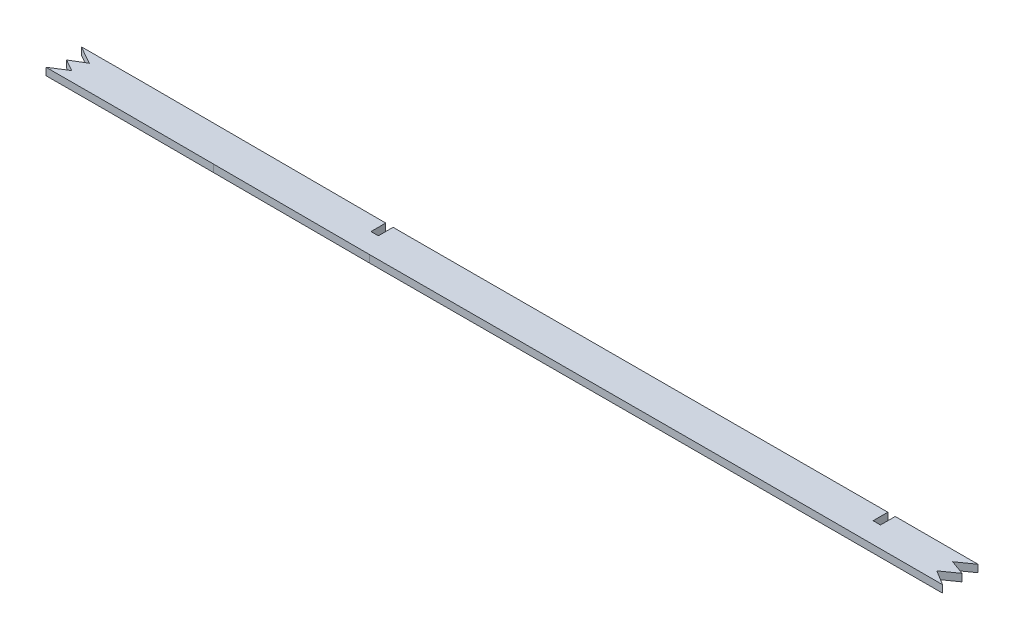
ISO-10303-21;
HEADER;
FILE_DESCRIPTION(('STEP AP214'),'2;1');
FILE_NAME('part.step','',(''),(''),'','','');
FILE_SCHEMA(('AUTOMOTIVE_DESIGN { 1 0 10303 214 1 1 1 1 }'));
ENDSEC;
DATA;
#1=APPLICATION_CONTEXT('core data for automotive mechanical design processes');
#2=APPLICATION_PROTOCOL_DEFINITION('international standard','automotive_design',2000,#1);
#3=PRODUCT_CONTEXT('',#1,'mechanical');
#4=PRODUCT('Part','Part','',(#3));
#5=PRODUCT_RELATED_PRODUCT_CATEGORY('part','',(#4));
#6=PRODUCT_DEFINITION_FORMATION('','',#4);
#7=PRODUCT_DEFINITION_CONTEXT('part definition',#1,'design');
#8=PRODUCT_DEFINITION('design','',#6,#7);
#9=PRODUCT_DEFINITION_SHAPE('','',#8);
#10=(LENGTH_UNIT() NAMED_UNIT(*) SI_UNIT(.MILLI.,.METRE.));
#11=(NAMED_UNIT(*) PLANE_ANGLE_UNIT() SI_UNIT($,.RADIAN.));
#12=(NAMED_UNIT(*) SI_UNIT($,.STERADIAN.) SOLID_ANGLE_UNIT());
#13=UNCERTAINTY_MEASURE_WITH_UNIT(LENGTH_MEASURE(1.E-05),#10,'distance_accuracy_value','');
#14=(GEOMETRIC_REPRESENTATION_CONTEXT(3) GLOBAL_UNCERTAINTY_ASSIGNED_CONTEXT((#13)) GLOBAL_UNIT_ASSIGNED_CONTEXT((#10,
#11,#12)) REPRESENTATION_CONTEXT('',''));
#15=CARTESIAN_POINT('',(0.,0.,0.));
#16=DIRECTION('',(0.,0.,1.));
#17=DIRECTION('',(1.,0.,0.));
#18=AXIS2_PLACEMENT_3D('',#15,#16,#17);
#19=CARTESIAN_POINT('',(616.337750913255,1.5875,99.0566103609531));
#20=CARTESIAN_POINT('',(647.76049660052,1.5875,99.0799542657679));
#21=CARTESIAN_POINT('',(694.87068034325,1.5875,98.960929783245));
#22=CARTESIAN_POINT('',(757.779786958647,1.5875,98.8040630386954));
#23=CARTESIAN_POINT('',(820.69045818609,1.5875,98.7653484328497));
#24=CARTESIAN_POINT('',(899.289299877085,1.5875,98.7967965825531));
#25=CARTESIAN_POINT('',(993.586772551322,1.5875,98.8129149281116));
#26=CARTESIAN_POINT('',(1087.93191592796,1.5875,98.7323574871025));
#27=CARTESIAN_POINT('',(1182.33953079348,1.5875,99.1244994990799));
#28=CARTESIAN_POINT('',(1276.65398068122,1.5875,99.8147611994573));
#29=CARTESIAN_POINT('',(1370.85083148495,1.5875,100.131815232071));
#30=CARTESIAN_POINT('',(1464.98207813977,1.5875,99.4108190462021));
#31=CARTESIAN_POINT('',(1590.54945268054,1.5875,97.1511702631117));
#32=CARTESIAN_POINT('',(1747.54008126415,1.5875,92.7833872927443));
#33=CARTESIAN_POINT('',(1904.58058478476,1.5875,87.4795525069474));
#34=CARTESIAN_POINT('',(2030.20455421821,1.5875,82.9558758992198));
#35=CARTESIAN_POINT('',(2092.98705848864,1.5875,80.5357121207426));
#36=CARTESIAN_POINT('',(2124.37829951673,1.5875,79.2527491986346));
#37=B_SPLINE_CURVE_WITH_KNOTS('',3,(#19,#20,#21,#22,#23,#24,#25,#26,#27,#28,#29,#30,#31,#32,#33,
#34,#35,#36),.UNSPECIFIED.,.F.,.F.,(4,1,1,1,1,1,1,1,1,1,1,1,1,1,1,4),(0.,0.0625,0.09375,0.125,
0.1875,0.25,0.3125,0.375,0.4375,0.5,0.5625,0.625,0.75,0.875,0.9375,1.),.UNSPECIFIED.);
#38=DIRECTION('',(0.,-1.,0.));
#39=VECTOR('',#38,1.);
#40=SURFACE_OF_LINEAR_EXTRUSION('',#37,#39);
#41=DIRECTION('',(0.,1.,0.));
#42=VECTOR('',#41,1.);
#43=CARTESIAN_POINT('',(823.912499990263,-1.59253086897977,98.7774754214839));
#44=LINE('',#43,#42);
#45=CARTESIAN_POINT('',(823.912499964225,-1.58973844599883,98.7777847920669));
#46=VERTEX_POINT('',#45);
#47=CARTESIAN_POINT('',(823.912499990263,1.5875,98.7774754214839));
#48=VERTEX_POINT('',#47);
#49=EDGE_CURVE('E417',#46,#48,#44,.T.);
#50=ORIENTED_EDGE('',*,*,#49,.F.);
#51=CARTESIAN_POINT('',(823.912499922751,-1.5875,98.7774754214864));
#52=CARTESIAN_POINT('',(817.595439514994,-1.5875,98.7777089056765));
#53=CARTESIAN_POINT('',(795.554034163958,-1.5875,98.7808171399768));
#54=CARTESIAN_POINT('',(757.779786958647,-1.5875,98.8040630386954));
#55=CARTESIAN_POINT('',(694.87068034325,-1.5875,98.960929783245));
#56=CARTESIAN_POINT('',(647.76049660052,-1.5875,99.0799542657679));
#57=CARTESIAN_POINT('',(616.337750913255,-1.5875,99.0566103609531));
#58=B_SPLINE_CURVE_WITH_KNOTS('',3,(#51,#52,#53,#54,#55,#56,#57),.UNSPECIFIED.,.F.,.F.,(4,1,1,1,
4),(0.,0.0125553254088321,0.0438053254088321,0.0750553254088321,0.137555325408832),.UNSPECIFIED.);
#59=CARTESIAN_POINT('',(616.337751022528,-1.5875,99.0566103610343));
#60=VERTEX_POINT('',#59);
#61=EDGE_CURVE('E572',#60,#46,#58,.F.);
#62=ORIENTED_EDGE('',*,*,#61,.F.);
#63=DIRECTION('',(0.,-1.,0.));
#64=VECTOR('',#63,1.);
#65=CARTESIAN_POINT('',(616.337751022528,1.5875,99.0566103610343));
#66=LINE('',#65,#64);
#67=CARTESIAN_POINT('',(616.337751022528,1.5875,99.0566103610343));
#68=VERTEX_POINT('',#67);
#69=EDGE_CURVE('E267',#68,#60,#66,.T.);
#70=ORIENTED_EDGE('',*,*,#69,.F.);
#71=EDGE_CURVE('E224',#68,#48,#37,.T.);
#72=ORIENTED_EDGE('',*,*,#71,.T.);
#73=EDGE_LOOP('',(#50,#62,#70,#72));
#74=FACE_BOUND('',#73,.T.);
#75=ADVANCED_FACE('F41',(#74),#40,.T.);
#76=DIRECTION('',(0.,1.,0.));
#77=VECTOR('',#76,1.);
#78=CARTESIAN_POINT('',(862.726409079902,-6.0325,98.7825807380737));
#79=LINE('',#78,#77);
#80=CARTESIAN_POINT('',(862.725924528318,-1.5875,98.7829220342023));
#81=VERTEX_POINT('',#80);
#82=CARTESIAN_POINT('',(862.726409079902,1.5875,98.7825807380737));
#83=VERTEX_POINT('',#82);
#84=EDGE_CURVE('E194',#81,#83,#79,.T.);
#85=ORIENTED_EDGE('',*,*,#84,.F.);
#86=CARTESIAN_POINT('',(862.72544015111,-1.5875,98.7825804906388));
#87=CARTESIAN_POINT('',(850.847143496278,-1.5875,98.7795471578253));
#88=CARTESIAN_POINT('',(838.967956108511,-1.5875,98.7773769776837));
#89=CARTESIAN_POINT('',(827.087499959189,-1.5875,98.7774124765953));
#90=B_SPLINE_CURVE_WITH_KNOTS('',3,(#86,#87,#88,#89),.UNSPECIFIED.,.F.,.F.,(4,4),
(0.139658811418409,0.163271988919623),.UNSPECIFIED.);
#91=CARTESIAN_POINT('',(827.087499978052,-1.58969133596749,98.7777814083418));
#92=VERTEX_POINT('',#91);
#93=EDGE_CURVE('E278',#92,#81,#90,.F.);
#94=ORIENTED_EDGE('',*,*,#93,.F.);
#95=DIRECTION('',(0.,1.,0.));
#96=VECTOR('',#95,1.);
#97=CARTESIAN_POINT('',(827.087499999964,-1.59253086897977,98.7774124765952));
#98=LINE('',#97,#96);
#99=CARTESIAN_POINT('',(827.087499999964,1.5875,98.7774124765952));
#100=VERTEX_POINT('',#99);
#101=EDGE_CURVE('E222',#92,#100,#98,.T.);
#102=ORIENTED_EDGE('',*,*,#101,.T.);
#103=EDGE_CURVE('E213',#100,#83,#37,.T.);
#104=ORIENTED_EDGE('',*,*,#103,.T.);
#105=EDGE_LOOP('',(#85,#94,#102,#104));
#106=FACE_BOUND('',#105,.T.);
#107=ADVANCED_FACE('F221',(#106),#40,.T.);
#108=CARTESIAN_POINT('',(549.050564999302,1.5875,98.8963567101024));
#109=CARTESIAN_POINT('',(554.659992112671,1.5875,98.915307063434));
#110=CARTESIAN_POINT('',(565.880376816721,1.5875,98.9529850983443));
#111=CARTESIAN_POINT('',(582.701799225793,1.5875,99.0023809587088));
#112=CARTESIAN_POINT('',(599.520778593028,1.5875,99.038450073442));
#113=CARTESIAN_POINT('',(610.731968980586,1.5875,99.0524457948082));
#114=CARTESIAN_POINT('',(616.337751022528,1.5875,99.0566103610343));
#115=B_SPLINE_CURVE_WITH_KNOTS('',3,(#108,#109,#110,#111,#112,#113,#114),.UNSPECIFIED.,.F.,.F.,
(4,1,1,1,4),(0.,0.25,0.5,0.75,1.),.UNSPECIFIED.);
#116=DIRECTION('',(0.,-1.,0.));
#117=VECTOR('',#116,1.);
#118=SURFACE_OF_LINEAR_EXTRUSION('',#115,#117);
#119=DIRECTION('',(0.,1.,0.));
#120=VECTOR('',#119,1.);
#121=CARTESIAN_POINT('',(608.01249999999,-1.59253086897977,99.0483812902524));
#122=LINE('',#121,#120);
#123=CARTESIAN_POINT('',(608.012499815169,-1.58985795550685,99.0482136230313));
#124=VERTEX_POINT('',#123);
#125=CARTESIAN_POINT('',(608.01249999999,1.5875,99.0483812902524));
#126=VERTEX_POINT('',#125);
#127=EDGE_CURVE('E404',#124,#126,#122,.T.);
#128=ORIENTED_EDGE('',*,*,#127,.F.);
#129=CARTESIAN_POINT('',(608.012499264184,-1.5875,99.0483812893479));
#130=CARTESIAN_POINT('',(605.181849636366,-1.5875,99.0449015445097));
#131=CARTESIAN_POINT('',(596.745401716536,-1.5875,99.0324981434942));
#132=CARTESIAN_POINT('',(582.701799225793,-1.5875,99.0023809587088));
#133=CARTESIAN_POINT('',(565.880376816721,-1.5875,98.9529850983443));
#134=CARTESIAN_POINT('',(554.659992112671,-1.5875,98.915307063434));
#135=CARTESIAN_POINT('',(549.050564999302,-1.5875,98.8963567101024));
#136=B_SPLINE_CURVE_WITH_KNOTS('',3,(#129,#130,#131,#132,#133,#134,#135),.UNSPECIFIED.,.F.,.F.,
(4,1,1,1,4),(0.,0.126239062316483,0.376239062316483,0.626239062316483,0.876239062316483),.UNSPECIFIED.);
#137=CARTESIAN_POINT('',(549.050564968239,-1.5875,98.8963567099974));
#138=VERTEX_POINT('',#137);
#139=EDGE_CURVE('E319',#138,#124,#136,.F.);
#140=ORIENTED_EDGE('',*,*,#139,.F.);
#141=DIRECTION('',(0.,-1.,0.));
#142=VECTOR('',#141,1.);
#143=CARTESIAN_POINT('',(549.050564968239,1.5875,98.8963567099974));
#144=LINE('',#143,#142);
#145=CARTESIAN_POINT('',(549.050564968239,1.5875,98.8963567099974));
#146=VERTEX_POINT('',#145);
#147=EDGE_CURVE('E648',#146,#138,#144,.T.);
#148=ORIENTED_EDGE('',*,*,#147,.F.);
#149=EDGE_CURVE('E242',#146,#126,#115,.T.);
#150=ORIENTED_EDGE('',*,*,#149,.T.);
#151=EDGE_LOOP('',(#128,#140,#148,#150));
#152=FACE_BOUND('',#151,.T.);
#153=ADVANCED_FACE('F677',(#152),#118,.T.);
#154=CARTESIAN_POINT('',(463.675537724596,1.5875,114.216461773581));
#155=CARTESIAN_POINT('',(470.785382475025,1.5875,114.125939241133));
#156=CARTESIAN_POINT('',(477.895647472131,1.5875,114.072781143216));
#157=CARTESIAN_POINT('',(492.116266715422,1.5875,114.019175519368));
#158=CARTESIAN_POINT('',(499.226625181021,1.5875,114.017353529523));
#159=CARTESIAN_POINT('',(520.557752109465,1.5875,114.038242979904));
#160=CARTESIAN_POINT('',(534.778415195442,1.5875,114.088228036349));
#161=CARTESIAN_POINT('',(548.999079931237,1.5875,114.13626974423));
#162=B_SPLINE_CURVE_WITH_KNOTS('',3,(#154,#155,#156,#157,#158,#159,#160,#161),.UNSPECIFIED.,.F.,
.F.,(4,2,2,4),(0.,0.25,0.5,1.),.UNSPECIFIED.);
#163=DIRECTION('',(0.,-1.,0.));
#164=VECTOR('',#163,1.);
#165=SURFACE_OF_LINEAR_EXTRUSION('',#162,#164);
#166=CARTESIAN_POINT('',(548.999079931237,1.5875,114.13626974423));
#167=CARTESIAN_POINT('',(534.778415195442,1.5875,114.088228036349));
#168=CARTESIAN_POINT('',(520.557752109465,1.5875,114.038242979904));
#169=CARTESIAN_POINT('',(499.226625181021,1.5875,114.017353529523));
#170=CARTESIAN_POINT('',(492.116266715422,1.5875,114.019175519368));
#171=CARTESIAN_POINT('',(482.269614731647,1.5875,114.056293166172));
#172=CARTESIAN_POINT('',(479.533278978546,1.5875,114.070511297854));
#173=CARTESIAN_POINT('',(476.7969712435,1.5875,114.089260205771));
#174=B_SPLINE_CURVE_WITH_KNOTS('',3,(#166,#167,#168,#169,#170,#171,#172,#173),.UNSPECIFIED.,.F.,
.F.,(4,2,2,4),(0.153789620011793,0.653789620011793,0.903789620011793,1.),.UNSPECIFIED.);
#175=CARTESIAN_POINT('',(476.79697154391,1.5875,114.089304049026));
#176=VERTEX_POINT('',#175);
#177=CARTESIAN_POINT('',(548.999079931237,1.5875,114.13626974423));
#178=VERTEX_POINT('',#177);
#179=EDGE_CURVE('E318',#176,#178,#174,.F.);
#180=ORIENTED_EDGE('',*,*,#179,.F.);
#181=DIRECTION('',(0.,1.,0.));
#182=VECTOR('',#181,1.);
#183=CARTESIAN_POINT('',(476.79704174266,-6.0325,114.089259738876));
#184=LINE('',#183,#182);
#185=CARTESIAN_POINT('',(476.797007157656,-1.5875,114.089281569274));
#186=VERTEX_POINT('',#185);
#187=EDGE_CURVE('E473',#186,#176,#184,.T.);
#188=ORIENTED_EDGE('',*,*,#187,.F.);
#189=CARTESIAN_POINT('',(476.796972276273,-1.5875,114.089260198695));
#190=CARTESIAN_POINT('',(479.533279667068,-1.5875,114.070511294277));
#191=CARTESIAN_POINT('',(482.269615075909,-1.5875,114.056293164874));
#192=CARTESIAN_POINT('',(492.116266715422,-1.5875,114.019175519368));
#193=CARTESIAN_POINT('',(499.226625181021,-1.5875,114.017353529523));
#194=CARTESIAN_POINT('',(520.557752109465,-1.5875,114.038242979904));
#195=CARTESIAN_POINT('',(534.778415195442,-1.5875,114.088228036349));
#196=CARTESIAN_POINT('',(548.999079931237,-1.5875,114.13626974423));
#197=B_SPLINE_CURVE_WITH_KNOTS('',3,(#189,#190,#191,#192,#193,#194,#195,#196),.UNSPECIFIED.,.F.,
.F.,(4,2,2,4),(0.153789632116112,0.25,0.5,1.),.UNSPECIFIED.);
#198=CARTESIAN_POINT('',(548.999079931237,-1.5875,114.13626974423));
#199=VERTEX_POINT('',#198);
#200=EDGE_CURVE('E407',#186,#199,#197,.T.);
#201=ORIENTED_EDGE('',*,*,#200,.T.);
#202=DIRECTION('',(0.,-1.,0.));
#203=VECTOR('',#202,1.);
#204=CARTESIAN_POINT('',(548.999079931237,1.5875,114.13626974423));
#205=LINE('',#204,#203);
#206=EDGE_CURVE('E285',#178,#199,#205,.T.);
#207=ORIENTED_EDGE('',*,*,#206,.F.);
#208=EDGE_LOOP('',(#180,#188,#201,#207));
#209=FACE_BOUND('',#208,.T.);
#210=ADVANCED_FACE('F43',(#209),#165,.F.);
#211=CARTESIAN_POINT('',(548.999079931237,1.5875,114.13626974423));
#212=CARTESIAN_POINT('',(560.220276671973,1.5875,114.174178364619));
#213=CARTESIAN_POINT('',(571.441476666726,1.5875,114.211622104004));
#214=CARTESIAN_POINT('',(593.883924595973,1.5875,114.268599334657));
#215=CARTESIAN_POINT('',(605.105170908965,1.5875,114.288269821201));
#216=CARTESIAN_POINT('',(616.326429146063,1.5875,114.296606155493));
#217=B_SPLINE_CURVE_WITH_KNOTS('',3,(#211,#212,#213,#214,#215,#216),.UNSPECIFIED.,.F.,.F.,(4,2,
4),(0.,0.5,1.),.UNSPECIFIED.);
#218=DIRECTION('',(0.,-1.,0.));
#219=VECTOR('',#218,1.);
#220=SURFACE_OF_LINEAR_EXTRUSION('',#217,#219);
#221=CARTESIAN_POINT('',(548.999079931237,-1.5875,114.13626974423));
#222=CARTESIAN_POINT('',(560.220276671973,-1.5875,114.174178364619));
#223=CARTESIAN_POINT('',(571.441476666726,-1.5875,114.211622104004));
#224=CARTESIAN_POINT('',(593.883924595973,-1.5875,114.268599334657));
#225=CARTESIAN_POINT('',(605.105170908965,-1.5875,114.288269821201));
#226=CARTESIAN_POINT('',(616.326429146063,-1.5875,114.296606155493));
#227=B_SPLINE_CURVE_WITH_KNOTS('',3,(#221,#222,#223,#224,#225,#226),.UNSPECIFIED.,.F.,.F.,(4,2,
4),(0.,0.5,1.),.UNSPECIFIED.);
#228=CARTESIAN_POINT('',(616.326429146063,-1.5875,114.296606155493));
#229=VERTEX_POINT('',#228);
#230=EDGE_CURVE('E593',#199,#229,#227,.T.);
#231=ORIENTED_EDGE('',*,*,#230,.T.);
#232=DIRECTION('',(0.,-1.,0.));
#233=VECTOR('',#232,1.);
#234=CARTESIAN_POINT('',(616.326429146063,1.5875,114.296606155493));
#235=LINE('',#234,#233);
#236=CARTESIAN_POINT('',(616.326429146063,1.5875,114.296606155493));
#237=VERTEX_POINT('',#236);
#238=EDGE_CURVE('E602',#237,#229,#235,.T.);
#239=ORIENTED_EDGE('',*,*,#238,.F.);
#240=CARTESIAN_POINT('',(616.326429146063,1.5875,114.296606155493));
#241=CARTESIAN_POINT('',(605.105170908965,1.5875,114.288269821201));
#242=CARTESIAN_POINT('',(593.883924595973,1.5875,114.268599334657));
#243=CARTESIAN_POINT('',(571.441476666726,1.5875,114.211622104004));
#244=CARTESIAN_POINT('',(560.220276671973,1.5875,114.174178364619));
#245=CARTESIAN_POINT('',(548.999079931237,1.5875,114.13626974423));
#246=B_SPLINE_CURVE_WITH_KNOTS('',3,(#240,#241,#242,#243,#244,#245),.UNSPECIFIED.,.F.,.F.,(4,2,
4),(0.,0.5,1.),.UNSPECIFIED.);
#247=EDGE_CURVE('E232',#178,#237,#246,.F.);
#248=ORIENTED_EDGE('',*,*,#247,.F.);
#249=ORIENTED_EDGE('',*,*,#206,.T.);
#250=EDGE_LOOP('',(#231,#239,#248,#249));
#251=FACE_BOUND('',#250,.T.);
#252=ADVANCED_FACE('F380',(#251),#220,.F.);
#253=CARTESIAN_POINT('',(616.326429146063,1.5875,114.296606155493));
#254=CARTESIAN_POINT('',(632.046217380175,1.5875,114.30828435968));
#255=CARTESIAN_POINT('',(647.765968153244,1.5875,114.29677439422));
#256=CARTESIAN_POINT('',(679.205420392794,1.5875,114.24323397025));
#257=CARTESIAN_POINT('',(694.925123066751,1.5875,114.201950932506));
#258=CARTESIAN_POINT('',(726.364532124698,1.5875,114.121681346548));
#259=CARTESIAN_POINT('',(742.084243399862,1.5875,114.083543006226));
#260=CARTESIAN_POINT('',(773.523671882744,1.5875,114.034083388907));
#261=CARTESIAN_POINT('',(789.243390213417,1.5875,114.023396075664));
#262=CARTESIAN_POINT('',(820.682831324826,1.5875,114.017303041489));
#263=CARTESIAN_POINT('',(836.402553623007,1.5875,114.020240225192));
#264=CARTESIAN_POINT('',(867.841997842806,1.5875,114.024821457385));
#265=CARTESIAN_POINT('',(883.561720421664,1.5875,114.028722489467));
#266=CARTESIAN_POINT('',(915.001165910892,1.5875,114.037662965197));
#267=CARTESIAN_POINT('',(930.720888644625,1.5875,114.042095840025));
#268=CARTESIAN_POINT('',(962.160332217753,1.5875,114.044456392842));
#269=CARTESIAN_POINT('',(977.880053630737,1.5875,114.042025852399));
#270=CARTESIAN_POINT('',(1025.03924062521,1.5875,114.02635266127));
#271=CARTESIAN_POINT('',(1056.47872633141,1.5875,114.001081239981));
#272=CARTESIAN_POINT('',(1103.63774370583,1.5875,114.076141518065));
#273=CARTESIAN_POINT('',(1119.35738201238,1.5875,114.119430036675));
#274=CARTESIAN_POINT('',(1150.79658971577,1.5875,114.242868384306));
#275=CARTESIAN_POINT('',(1166.51615941665,1.5875,114.322855573181));
#276=CARTESIAN_POINT('',(1213.67480633689,1.5875,114.596079866728));
#277=CARTESIAN_POINT('',(1245.11381381393,1.5875,114.824335417931));
#278=CARTESIAN_POINT('',(1307.99206873737,1.5875,115.160349224997));
#279=CARTESIAN_POINT('',(1339.43132783757,1.5875,115.262775920084));
#280=CARTESIAN_POINT('',(1386.59071758969,1.5875,115.166774968219));
#281=CARTESIAN_POINT('',(1402.31059775436,1.5875,115.09313610926));
#282=CARTESIAN_POINT('',(1433.75053971329,1.5875,114.855373393272));
#283=CARTESIAN_POINT('',(1449.46971812607,1.5875,114.691491377402));
#284=CARTESIAN_POINT('',(1480.90524720166,1.5875,114.282993412757));
#285=CARTESIAN_POINT('',(1496.62184273389,1.5875,114.038617844409));
#286=CARTESIAN_POINT('',(1528.05323424889,1.5875,113.488096449305));
#287=CARTESIAN_POINT('',(1543.76803918056,1.5875,113.182257797232));
#288=CARTESIAN_POINT('',(1590.91012672281,1.5875,112.184857954141));
#289=CARTESIAN_POINT('',(1622.33508716355,1.5875,111.413587350345));
#290=CARTESIAN_POINT('',(1685.18062244756,1.5875,109.720508746898));
#291=CARTESIAN_POINT('',(1716.60120600918,1.5875,108.799000007991));
#292=CARTESIAN_POINT('',(1779.43954296825,1.5875,106.858836007746));
#293=CARTESIAN_POINT('',(1810.85730451947,1.5875,105.840460627799));
#294=CARTESIAN_POINT('',(1873.69102784609,1.5875,103.741931839349));
#295=CARTESIAN_POINT('',(1905.10699770462,1.5875,102.662055887814));
#296=CARTESIAN_POINT('',(1967.93740090808,1.5875,100.449562537391));
#297=CARTESIAN_POINT('',(1999.35184226252,1.5875,99.3172200683351));
#298=CARTESIAN_POINT('',(2062.17844269824,1.5875,96.9741951872324));
#299=CARTESIAN_POINT('',(2093.59060920955,1.5875,95.7637678134024));
#300=CARTESIAN_POINT('',(2125.00064017427,1.5875,94.4800369448474));
#301=B_SPLINE_CURVE_WITH_KNOTS('',3,(#253,#254,#255,#256,#257,#258,#259,#260,#261,#262,#263,
#264,#265,#266,#267,#268,#269,#270,#271,#272,#273,#274,#275,#276,#277,#278,#279,#280,#281,#282,
#283,#284,#285,#286,#287,#288,#289,#290,#291,#292,#293,#294,#295,#296,#297,#298,#299,#300),
.UNSPECIFIED.,.F.,.F.,(4,2,2,2,2,2,2,2,2,2,2,2,2,2,2,2,2,2,2,2,2,2,2,4),(0.,0.0312499999999999,
0.0624999999999998,0.0937499999999997,0.125,0.156249999999999,0.187499999999999,
0.218749999999999,0.249999999999999,0.312499999999999,0.343749999999999,0.374999999999999,
0.437499999999998,0.499999999999998,0.531249999999998,0.562499999999998,0.593749999999999,
0.624999999999999,0.687499999999999,0.749999999999999,0.812499999999999,0.875,0.9375,1.),.UNSPECIFIED.);
#302=DIRECTION('',(0.,-1.,0.));
#303=VECTOR('',#302,1.);
#304=SURFACE_OF_LINEAR_EXTRUSION('',#301,#303);
#305=CARTESIAN_POINT('',(616.326429146063,-1.5875,114.296606155493));
#306=CARTESIAN_POINT('',(632.046217380175,-1.5875,114.30828435968));
#307=CARTESIAN_POINT('',(647.765968153244,-1.5875,114.29677439422));
#308=CARTESIAN_POINT('',(679.205420392794,-1.5875,114.24323397025));
#309=CARTESIAN_POINT('',(694.925123066751,-1.5875,114.201950932506));
#310=CARTESIAN_POINT('',(726.364532124698,-1.5875,114.121681346548));
#311=CARTESIAN_POINT('',(742.084243399862,-1.5875,114.083543006226));
#312=CARTESIAN_POINT('',(773.523671882744,-1.5875,114.034083388907));
#313=CARTESIAN_POINT('',(789.243390213417,-1.5875,114.023396075664));
#314=CARTESIAN_POINT('',(820.682831324826,-1.5875,114.017303041489));
#315=CARTESIAN_POINT('',(836.402553623007,-1.5875,114.020240225192));
#316=CARTESIAN_POINT('',(855.656990716188,-1.5875,114.023045906057));
#317=CARTESIAN_POINT('',(859.191705723181,-1.5875,114.02364239571));
#318=CARTESIAN_POINT('',(862.726420750438,-1.5875,114.024308472554));
#319=B_SPLINE_CURVE_WITH_KNOTS('',3,(#305,#306,#307,#308,#309,#310,#311,#312,#313,#314,#315,
#316,#317,#318),.UNSPECIFIED.,.F.,.F.,(4,2,2,2,2,2,4),(0.,0.0312499999999999,0.0624999999999998,
0.0937499999999997,0.125,0.156249999999999,0.163276831801179),.UNSPECIFIED.);
#320=CARTESIAN_POINT('',(862.726414914492,-1.5875,114.024312034321));
#321=VERTEX_POINT('',#320);
#322=EDGE_CURVE('E590',#229,#321,#319,.T.);
#323=ORIENTED_EDGE('',*,*,#322,.T.);
#324=DIRECTION('',(0.,1.,0.));
#325=VECTOR('',#324,1.);
#326=CARTESIAN_POINT('',(862.726409079902,-6.0325,114.024308470354));
#327=LINE('',#326,#325);
#328=CARTESIAN_POINT('',(862.726420742764,1.5875,114.024315595951));
#329=VERTEX_POINT('',#328);
#330=EDGE_CURVE('E442',#321,#329,#327,.T.);
#331=ORIENTED_EDGE('',*,*,#330,.T.);
#332=CARTESIAN_POINT('',(862.726420744107,1.5875,114.024308472553));
#333=CARTESIAN_POINT('',(859.19170571896,1.5875,114.023642395709));
#334=CARTESIAN_POINT('',(855.656990714078,1.5875,114.023045906057));
#335=CARTESIAN_POINT('',(836.402553623007,1.5875,114.020240225192));
#336=CARTESIAN_POINT('',(820.682831324826,1.5875,114.017303041489));
#337=CARTESIAN_POINT('',(789.243390213417,1.5875,114.023396075664));
#338=CARTESIAN_POINT('',(773.523671882744,1.5875,114.034083388907));
#339=CARTESIAN_POINT('',(742.084243399862,1.5875,114.083543006226));
#340=CARTESIAN_POINT('',(726.364532124698,1.5875,114.121681346548));
#341=CARTESIAN_POINT('',(694.925123066751,1.5875,114.201950932506));
#342=CARTESIAN_POINT('',(679.205420392794,1.5875,114.24323397025));
#343=CARTESIAN_POINT('',(647.765968153244,1.5875,114.29677439422));
#344=CARTESIAN_POINT('',(632.046217380175,1.5875,114.30828435968));
#345=CARTESIAN_POINT('',(616.326429146063,1.5875,114.296606155493));
#346=B_SPLINE_CURVE_WITH_KNOTS('',3,(#332,#333,#334,#335,#336,#337,#338,#339,#340,#341,#342,
#343,#344,#345),.UNSPECIFIED.,.F.,.F.,(4,2,2,2,2,2,4),(0.,0.00702683179698438,
0.0382768317969843,0.0695268317969842,0.100776831796984,0.132026831796984,0.163276831796984),.UNSPECIFIED.);
#347=EDGE_CURVE('E225',#237,#329,#346,.F.);
#348=ORIENTED_EDGE('',*,*,#347,.F.);
#349=ORIENTED_EDGE('',*,*,#238,.T.);
#350=EDGE_LOOP('',(#323,#331,#348,#349));
#351=FACE_BOUND('',#350,.T.);
#352=ADVANCED_FACE('F258',(#351),#304,.F.);
#353=DIRECTION('',(0.,1.,0.));
#354=VECTOR('',#353,1.);
#355=CARTESIAN_POINT('',(611.1875,-1.59253086897977,99.0519962069986));
#356=LINE('',#355,#354);
#357=CARTESIAN_POINT('',(611.18749993328,-1.58994719327401,99.0519260885511));
#358=VERTEX_POINT('',#357);
#359=CARTESIAN_POINT('',(611.1875,1.5875,99.0519962069986));
#360=VERTEX_POINT('',#359);
#361=EDGE_CURVE('E408',#358,#360,#356,.T.);
#362=ORIENTED_EDGE('',*,*,#361,.T.);
#363=EDGE_CURVE('E230',#360,#68,#115,.T.);
#364=ORIENTED_EDGE('',*,*,#363,.T.);
#365=ORIENTED_EDGE('',*,*,#69,.T.);
#366=CARTESIAN_POINT('',(616.337751022528,-1.5875,99.0566103610343));
#367=CARTESIAN_POINT('',(614.620988356102,-1.5875,99.0553349686331));
#368=CARTESIAN_POINT('',(612.904243213825,-1.5875,99.0537938467036));
#369=CARTESIAN_POINT('',(611.187499727118,-1.5875,99.0519962067128));
#370=B_SPLINE_CURVE_WITH_KNOTS('',3,(#366,#367,#368,#369),.UNSPECIFIED.,.F.,.F.,(4,4),
(0.923437860517,1.),.UNSPECIFIED.);
#371=EDGE_CURVE('E582',#358,#60,#370,.F.);
#372=ORIENTED_EDGE('',*,*,#371,.F.);
#373=EDGE_LOOP('',(#362,#364,#365,#372));
#374=FACE_BOUND('',#373,.T.);
#375=ADVANCED_FACE('F255',(#374),#118,.T.);
#376=CARTESIAN_POINT('',(463.481517793035,1.5875,98.977696854266));
#377=CARTESIAN_POINT('',(470.636830326676,1.5875,98.8865954260712));
#378=CARTESIAN_POINT('',(484.96517985863,1.5875,98.7802909739378));
#379=CARTESIAN_POINT('',(506.357680508781,1.5875,98.7756080986052));
#380=CARTESIAN_POINT('',(527.715649674398,1.5875,98.8232205557799));
#381=CARTESIAN_POINT('',(541.937533287806,1.5875,98.8723267369625));
#382=CARTESIAN_POINT('',(549.050564968239,1.5875,98.8963567099974));
#383=B_SPLINE_CURVE_WITH_KNOTS('',3,(#376,#377,#378,#379,#380,#381,#382),.UNSPECIFIED.,.F.,.F.,
(4,1,1,1,4),(0.,0.25,0.5,0.75,1.),.UNSPECIFIED.);
#384=DIRECTION('',(0.,-1.,0.));
#385=VECTOR('',#384,1.);
#386=SURFACE_OF_LINEAR_EXTRUSION('',#383,#385);
#387=DIRECTION('',(0.,1.,0.));
#388=VECTOR('',#387,1.);
#389=CARTESIAN_POINT('',(476.79704174266,-6.0325,98.8490976113296));
#390=LINE('',#389,#388);
#391=CARTESIAN_POINT('',(476.79704174266,-1.5875,98.8490976113296));
#392=VERTEX_POINT('',#391);
#393=CARTESIAN_POINT('',(476.79704174266,1.5875,98.8490976113296));
#394=VERTEX_POINT('',#393);
#395=EDGE_CURVE('E218',#392,#394,#390,.T.);
#396=ORIENTED_EDGE('',*,*,#395,.T.);
#397=EDGE_CURVE('E47',#394,#146,#383,.T.);
#398=ORIENTED_EDGE('',*,*,#397,.T.);
#399=ORIENTED_EDGE('',*,*,#147,.T.);
#400=CARTESIAN_POINT('',(463.481517793035,-1.5875,98.977696854266));
#401=CARTESIAN_POINT('',(470.636830326676,-1.5875,98.8865954260712));
#402=CARTESIAN_POINT('',(484.96517985863,-1.5875,98.7802909739378));
#403=CARTESIAN_POINT('',(506.357680508781,-1.5875,98.7756080986052));
#404=CARTESIAN_POINT('',(527.715649674398,-1.5875,98.8232205557799));
#405=CARTESIAN_POINT('',(541.937533287806,-1.5875,98.8723267369625));
#406=CARTESIAN_POINT('',(549.050564968239,-1.5875,98.8963567099974));
#407=B_SPLINE_CURVE_WITH_KNOTS('',3,(#400,#401,#402,#403,#404,#405,#406),.UNSPECIFIED.,.F.,.F.,
(4,1,1,1,4),(0.,0.25,0.5,0.75,1.),.UNSPECIFIED.);
#408=EDGE_CURVE('E314',#392,#138,#407,.T.);
#409=ORIENTED_EDGE('',*,*,#408,.F.);
#410=EDGE_LOOP('',(#396,#398,#399,#409));
#411=FACE_BOUND('',#410,.T.);
#412=ADVANCED_FACE('F349',(#411),#386,.T.);
#413=CARTESIAN_POINT('',(0.,1.5875,0.));
#414=DIRECTION('',(0.,1.,0.));
#415=DIRECTION('',(0.,0.,1.));
#416=AXIS2_PLACEMENT_3D('',#413,#414,#415);
#417=PLANE('',#416);
#418=DIRECTION('',(0.853386844339415,0.,0.521278134884263));
#419=VECTOR('',#418,1.);
#420=CARTESIAN_POINT('',(856.314728224219,1.5875,110.107832536734));
#421=LINE('',#420,#419);
#422=CARTESIAN_POINT('',(856.314728224219,1.5875,110.107832536734));
#423=VERTEX_POINT('',#422);
#424=EDGE_CURVE('E206',#423,#329,#421,.T.);
#425=ORIENTED_EDGE('',*,*,#424,.F.);
#426=DIRECTION('',(-0.81759879462083,0.,0.57578833874486));
#427=VECTOR('',#426,1.);
#428=CARTESIAN_POINT('',(862.726409079902,1.5875,105.592450306788));
#429=LINE('',#428,#427);
#430=CARTESIAN_POINT('',(862.726409079902,1.5875,105.592450306788));
#431=VERTEX_POINT('',#430);
#432=EDGE_CURVE('E471',#431,#423,#429,.T.);
#433=ORIENTED_EDGE('',*,*,#432,.F.);
#434=DIRECTION('',(0.941527703429056,0.,0.336935577930867));
#435=VECTOR('',#434,1.);
#436=CARTESIAN_POINT('',(856.314728224219,1.5875,103.297962968019));
#437=LINE('',#436,#435);
#438=CARTESIAN_POINT('',(856.314728224219,1.5875,103.297962968019));
#439=VERTEX_POINT('',#438);
#440=EDGE_CURVE('E216',#439,#431,#437,.T.);
#441=ORIENTED_EDGE('',*,*,#440,.F.);
#442=DIRECTION('',(-0.817598794620829,0.,0.575788338744861));
#443=VECTOR('',#442,1.);
#444=CARTESIAN_POINT('',(862.726409079902,1.5875,98.7825807380737));
#445=LINE('',#444,#443);
#446=EDGE_CURVE('E197',#83,#439,#445,.T.);
#447=ORIENTED_EDGE('',*,*,#446,.F.);
#448=ORIENTED_EDGE('',*,*,#103,.F.);
#449=DIRECTION('',(-5.57732506338732E-12,0.,-1.));
#450=VECTOR('',#449,1.);
#451=CARTESIAN_POINT('',(827.087499999414,1.5875,-4.61293584336109E-09));
#452=LINE('',#451,#450);
#453=CARTESIAN_POINT('',(827.0875,1.5875,105.127430466049));
#454=VERTEX_POINT('',#453);
#455=EDGE_CURVE('E429',#454,#100,#452,.T.);
#456=ORIENTED_EDGE('',*,*,#455,.F.);
#457=DIRECTION('',(1.,0.,0.));
#458=VECTOR('',#457,1.);
#459=CARTESIAN_POINT('',(0.,1.5875,105.127430466049));
#460=LINE('',#459,#458);
#461=CARTESIAN_POINT('',(823.9125,1.5875,105.127430466049));
#462=VERTEX_POINT('',#461);
#463=EDGE_CURVE('E434',#462,#454,#460,.T.);
#464=ORIENTED_EDGE('',*,*,#463,.F.);
#465=DIRECTION('',(6.0844149266884E-12,0.,1.));
#466=VECTOR('',#465,1.);
#467=CARTESIAN_POINT('',(823.91249999936,1.5875,-5.01302551328127E-09));
#468=LINE('',#467,#466);
#469=EDGE_CURVE('E438',#48,#462,#468,.T.);
#470=ORIENTED_EDGE('',*,*,#469,.F.);
#471=ORIENTED_EDGE('',*,*,#71,.F.);
#472=ORIENTED_EDGE('',*,*,#363,.F.);
#473=DIRECTION('',(2.2735187751597E-13,0.,-1.));
#474=VECTOR('',#473,1.);
#475=CARTESIAN_POINT('',(611.187500000023,1.5875,1.38954625639297E-10));
#476=LINE('',#475,#474);
#477=CARTESIAN_POINT('',(611.187499999999,1.5875,105.400261054344));
#478=VERTEX_POINT('',#477);
#479=EDGE_CURVE('E446',#478,#360,#476,.T.);
#480=ORIENTED_EDGE('',*,*,#479,.F.);
#481=DIRECTION('',(1.,0.,0.));
#482=VECTOR('',#481,1.);
#483=CARTESIAN_POINT('',(0.,1.5875,105.400261054344));
#484=LINE('',#483,#482);
#485=CARTESIAN_POINT('',(608.012499999999,1.5875,105.400261054344));
#486=VERTEX_POINT('',#485);
#487=EDGE_CURVE('E451',#486,#478,#484,.T.);
#488=ORIENTED_EDGE('',*,*,#487,.F.);
#489=DIRECTION('',(1.39829224211881E-12,0.,1.));
#490=VECTOR('',#489,1.);
#491=CARTESIAN_POINT('',(608.012499999852,1.5875,-8.50179161861058E-10));
#492=LINE('',#491,#490);
#493=EDGE_CURVE('E420',#126,#486,#492,.T.);
#494=ORIENTED_EDGE('',*,*,#493,.F.);
#495=ORIENTED_EDGE('',*,*,#149,.F.);
#496=ORIENTED_EDGE('',*,*,#397,.F.);
#497=DIRECTION('',(-0.869563376637202,0.,-0.493821358399277));
#498=VECTOR('',#497,1.);
#499=CARTESIAN_POINT('',(476.79704174266,1.5875,98.8490976113296));
#500=LINE('',#499,#498);
#501=CARTESIAN_POINT('',(484.630988808675,1.5875,103.297962968019));
#502=VERTEX_POINT('',#501);
#503=EDGE_CURVE('E476',#502,#394,#500,.T.);
#504=ORIENTED_EDGE('',*,*,#503,.F.);
#505=DIRECTION('',(0.858817935730487,0.,-0.512280931977392));
#506=VECTOR('',#505,1.);
#507=CARTESIAN_POINT('',(484.630988808675,1.5875,103.297962968019));
#508=LINE('',#507,#506);
#509=CARTESIAN_POINT('',(478.528826473051,1.5875,106.937874616711));
#510=VERTEX_POINT('',#509);
#511=EDGE_CURVE('E487',#510,#502,#508,.T.);
#512=ORIENTED_EDGE('',*,*,#511,.F.);
#513=DIRECTION('',(-0.869563376637212,0.,-0.49382135839926));
#514=VECTOR('',#513,1.);
#515=CARTESIAN_POINT('',(478.528826473051,1.5875,106.937874616711));
#516=LINE('',#515,#514);
#517=CARTESIAN_POINT('',(483.58113460883,1.5875,109.807059007054));
#518=VERTEX_POINT('',#517);
#519=EDGE_CURVE('E482',#518,#510,#516,.T.);
#520=ORIENTED_EDGE('',*,*,#519,.F.);
#521=DIRECTION('',(0.845628975685396,0.,-0.533771145231051));
#522=VECTOR('',#521,1.);
#523=CARTESIAN_POINT('',(483.58113460883,1.5875,109.807059007054));
#524=LINE('',#523,#522);
#525=EDGE_CURVE('E480',#176,#518,#524,.T.);
#526=ORIENTED_EDGE('',*,*,#525,.F.);
#527=ORIENTED_EDGE('',*,*,#179,.T.);
#528=ORIENTED_EDGE('',*,*,#247,.T.);
#529=ORIENTED_EDGE('',*,*,#347,.T.);
#530=EDGE_LOOP('',(#425,#433,#441,#447,#448,#456,#464,#470,#471,#472,#480,#488,#494,#495,#496,
#504,#512,#520,#526,#527,#528,#529));
#531=FACE_BOUND('',#530,.T.);
#532=ADVANCED_FACE('F211',(#531),#417,.T.);
#533=CARTESIAN_POINT('',(0.,-1.5875,0.));
#534=DIRECTION('',(0.,1.,0.));
#535=DIRECTION('',(0.,0.,1.));
#536=AXIS2_PLACEMENT_3D('',#533,#534,#535);
#537=PLANE('',#536);
#538=DIRECTION('',(-0.81759879462083,0.,0.57578833874486));
#539=VECTOR('',#538,1.);
#540=CARTESIAN_POINT('',(335.73070253857,-1.5875,476.725559102319));
#541=LINE('',#540,#539);
#542=CARTESIAN_POINT('',(862.726409079902,-1.5875,105.592450306788));
#543=VERTEX_POINT('',#542);
#544=CARTESIAN_POINT('',(856.314728224219,-1.5875,110.107832536734));
#545=VERTEX_POINT('',#544);
#546=EDGE_CURVE('E54',#543,#545,#541,.T.);
#547=ORIENTED_EDGE('',*,*,#546,.T.);
#548=DIRECTION('',(0.853386844339415,0.,0.521278134884263));
#549=VECTOR('',#548,1.);
#550=CARTESIAN_POINT('',(183.705487777464,-1.5875,-300.745103258648));
#551=LINE('',#550,#549);
#552=EDGE_CURVE('E11',#545,#321,#551,.T.);
#553=ORIENTED_EDGE('',*,*,#552,.T.);
#554=ORIENTED_EDGE('',*,*,#322,.F.);
#555=ORIENTED_EDGE('',*,*,#230,.F.);
#556=ORIENTED_EDGE('',*,*,#200,.F.);
#557=DIRECTION('',(0.845628975685396,0.,-0.533771145231051));
#558=VECTOR('',#557,1.);
#559=CARTESIAN_POINT('',(187.341761867647,-1.5875,296.796901830767));
#560=LINE('',#559,#558);
#561=CARTESIAN_POINT('',(483.58113460883,-1.5875,109.807059007054));
#562=VERTEX_POINT('',#561);
#563=EDGE_CURVE('E311',#186,#562,#560,.T.);
#564=ORIENTED_EDGE('',*,*,#563,.T.);
#565=DIRECTION('',(-0.869563376637212,0.,-0.49382135839926));
#566=VECTOR('',#565,1.);
#567=CARTESIAN_POINT('',(70.7737342698243,-1.5875,-124.624515125034));
#568=LINE('',#567,#566);
#569=CARTESIAN_POINT('',(478.528826473051,-1.5875,106.937874616711));
#570=VERTEX_POINT('',#569);
#571=EDGE_CURVE('E511',#562,#570,#568,.T.);
#572=ORIENTED_EDGE('',*,*,#571,.T.);
#573=DIRECTION('',(0.858817935730487,0.,-0.512280931977392));
#574=VECTOR('',#573,1.);
#575=CARTESIAN_POINT('',(172.629124101125,-1.5875,289.405634200012));
#576=LINE('',#575,#574);
#577=CARTESIAN_POINT('',(484.630988808675,-1.5875,103.297962968019));
#578=VERTEX_POINT('',#577);
#579=EDGE_CURVE('E516',#570,#578,#576,.T.);
#580=ORIENTED_EDGE('',*,*,#579,.T.);
#581=DIRECTION('',(-0.869563376637202,0.,-0.493821358399277));
#582=VECTOR('',#581,1.);
#583=CARTESIAN_POINT('',(73.824815437643,-1.5875,-129.997122845525));
#584=LINE('',#583,#582);
#585=EDGE_CURVE('E530',#578,#392,#584,.T.);
#586=ORIENTED_EDGE('',*,*,#585,.T.);
#587=ORIENTED_EDGE('',*,*,#408,.T.);
#588=ORIENTED_EDGE('',*,*,#139,.T.);
#589=DIRECTION('',(1.39829224211881E-12,0.,1.));
#590=VECTOR('',#589,1.);
#591=CARTESIAN_POINT('',(608.012499999852,-1.5875,-8.50179161861058E-10));
#592=LINE('',#591,#590);
#593=CARTESIAN_POINT('',(608.012499999999,-1.5875,105.400261054344));
#594=VERTEX_POINT('',#593);
#595=EDGE_CURVE('E305',#124,#594,#592,.T.);
#596=ORIENTED_EDGE('',*,*,#595,.T.);
#597=DIRECTION('',(1.,0.,0.));
#598=VECTOR('',#597,1.);
#599=CARTESIAN_POINT('',(0.,-1.5875,105.400261054344));
#600=LINE('',#599,#598);
#601=CARTESIAN_POINT('',(611.187499999999,-1.5875,105.400261054344));
#602=VERTEX_POINT('',#601);
#603=EDGE_CURVE('E295',#594,#602,#600,.T.);
#604=ORIENTED_EDGE('',*,*,#603,.T.);
#605=DIRECTION('',(2.2735187751597E-13,0.,-1.));
#606=VECTOR('',#605,1.);
#607=CARTESIAN_POINT('',(611.187500000023,-1.5875,1.38954625639297E-10));
#608=LINE('',#607,#606);
#609=EDGE_CURVE('E301',#602,#358,#608,.T.);
#610=ORIENTED_EDGE('',*,*,#609,.T.);
#611=ORIENTED_EDGE('',*,*,#371,.T.);
#612=ORIENTED_EDGE('',*,*,#61,.T.);
#613=DIRECTION('',(6.0844149266884E-12,0.,1.));
#614=VECTOR('',#613,1.);
#615=CARTESIAN_POINT('',(823.91249999936,-1.5875,-5.01302551328127E-09));
#616=LINE('',#615,#614);
#617=CARTESIAN_POINT('',(823.9125,-1.5875,105.127430466049));
#618=VERTEX_POINT('',#617);
#619=EDGE_CURVE('E289',#46,#618,#616,.T.);
#620=ORIENTED_EDGE('',*,*,#619,.T.);
#621=DIRECTION('',(1.,0.,0.));
#622=VECTOR('',#621,1.);
#623=CARTESIAN_POINT('',(0.,-1.5875,105.127430466049));
#624=LINE('',#623,#622);
#625=CARTESIAN_POINT('',(827.0875,-1.5875,105.127430466049));
#626=VERTEX_POINT('',#625);
#627=EDGE_CURVE('E280',#618,#626,#624,.T.);
#628=ORIENTED_EDGE('',*,*,#627,.T.);
#629=DIRECTION('',(-5.57732506338732E-12,0.,-1.));
#630=VECTOR('',#629,1.);
#631=CARTESIAN_POINT('',(827.087499999414,-1.5875,-4.61293584336109E-09));
#632=LINE('',#631,#630);
#633=EDGE_CURVE('E284',#626,#92,#632,.T.);
#634=ORIENTED_EDGE('',*,*,#633,.T.);
#635=ORIENTED_EDGE('',*,*,#93,.T.);
#636=DIRECTION('',(-0.817598794620829,0.,0.575788338744861));
#637=VECTOR('',#636,1.);
#638=CARTESIAN_POINT('',(332.524862110729,-1.5875,472.173380648578));
#639=LINE('',#638,#637);
#640=CARTESIAN_POINT('',(856.314728224219,-1.5875,103.29796296802));
#641=VERTEX_POINT('',#640);
#642=EDGE_CURVE('E200',#81,#641,#639,.T.);
#643=ORIENTED_EDGE('',*,*,#642,.T.);
#644=DIRECTION('',(0.941527703429056,0.,0.336935577930867));
#645=VECTOR('',#644,1.);
#646=CARTESIAN_POINT('',(64.44398466162,-1.5875,-180.081299965069));
#647=LINE('',#646,#645);
#648=EDGE_CURVE('E536',#641,#543,#647,.T.);
#649=ORIENTED_EDGE('',*,*,#648,.T.);
#650=EDGE_LOOP('',(#547,#553,#554,#555,#556,#564,#572,#580,#586,#587,#588,#596,#604,#610,#611,
#612,#620,#628,#634,#635,#643,#649));
#651=FACE_BOUND('',#650,.T.);
#652=ADVANCED_FACE('F348',(#651),#537,.F.);
#653=CARTESIAN_POINT('',(823.91249999936,-1.59253086897977,-5.01302551328127E-09));
#654=DIRECTION('',(-1.,0.,6.0844149266884E-12));
#655=DIRECTION('',(6.0844149266884E-12,0.,1.));
#656=AXIS2_PLACEMENT_3D('',#653,#654,#655);
#657=PLANE('',#656);
#658=ORIENTED_EDGE('',*,*,#49,.T.);
#659=ORIENTED_EDGE('',*,*,#469,.T.);
#660=DIRECTION('',(0.,1.,0.));
#661=VECTOR('',#660,1.);
#662=CARTESIAN_POINT('',(823.9125,-1.59253086897977,105.127430466049));
#663=LINE('',#662,#661);
#664=EDGE_CURVE('E426',#618,#462,#663,.T.);
#665=ORIENTED_EDGE('',*,*,#664,.F.);
#666=ORIENTED_EDGE('',*,*,#619,.F.);
#667=EDGE_LOOP('',(#658,#659,#665,#666));
#668=FACE_BOUND('',#667,.T.);
#669=ADVANCED_FACE('F350',(#668),#657,.F.);
#670=CARTESIAN_POINT('',(827.087499999414,-1.59253086897977,-4.61293584336109E-09));
#671=DIRECTION('',(1.,0.,-5.57732506338732E-12));
#672=DIRECTION('',(-5.57732506338732E-12,0.,-1.));
#673=AXIS2_PLACEMENT_3D('',#670,#671,#672);
#674=PLANE('',#673);
#675=DIRECTION('',(0.,1.,0.));
#676=VECTOR('',#675,1.);
#677=CARTESIAN_POINT('',(827.0875,-1.59253086897977,105.127430466049));
#678=LINE('',#677,#676);
#679=EDGE_CURVE('E425',#626,#454,#678,.T.);
#680=ORIENTED_EDGE('',*,*,#679,.T.);
#681=ORIENTED_EDGE('',*,*,#455,.T.);
#682=ORIENTED_EDGE('',*,*,#101,.F.);
#683=ORIENTED_EDGE('',*,*,#633,.F.);
#684=EDGE_LOOP('',(#680,#681,#682,#683));
#685=FACE_BOUND('',#684,.T.);
#686=ADVANCED_FACE('F738',(#685),#674,.F.);
#687=CARTESIAN_POINT('',(0.,-1.59253086897977,105.127430466049));
#688=DIRECTION('',(0.,0.,1.));
#689=DIRECTION('',(1.,0.,0.));
#690=AXIS2_PLACEMENT_3D('',#687,#688,#689);
#691=PLANE('',#690);
#692=ORIENTED_EDGE('',*,*,#664,.T.);
#693=ORIENTED_EDGE('',*,*,#463,.T.);
#694=ORIENTED_EDGE('',*,*,#679,.F.);
#695=ORIENTED_EDGE('',*,*,#627,.F.);
#696=EDGE_LOOP('',(#692,#693,#694,#695));
#697=FACE_BOUND('',#696,.T.);
#698=ADVANCED_FACE('F736',(#697),#691,.F.);
#699=CARTESIAN_POINT('',(608.012499999852,-1.59253086897977,-8.50179161861058E-10));
#700=DIRECTION('',(-1.,0.,1.39829224211881E-12));
#701=DIRECTION('',(1.39829224211881E-12,0.,1.));
#702=AXIS2_PLACEMENT_3D('',#699,#700,#701);
#703=PLANE('',#702);
#704=ORIENTED_EDGE('',*,*,#127,.T.);
#705=ORIENTED_EDGE('',*,*,#493,.T.);
#706=DIRECTION('',(0.,1.,0.));
#707=VECTOR('',#706,1.);
#708=CARTESIAN_POINT('',(608.012499999999,-1.59253086897977,105.400261054344));
#709=LINE('',#708,#707);
#710=EDGE_CURVE('E443',#594,#486,#709,.T.);
#711=ORIENTED_EDGE('',*,*,#710,.F.);
#712=ORIENTED_EDGE('',*,*,#595,.F.);
#713=EDGE_LOOP('',(#704,#705,#711,#712));
#714=FACE_BOUND('',#713,.T.);
#715=ADVANCED_FACE('F729',(#714),#703,.F.);
#716=CARTESIAN_POINT('',(611.187500000023,-1.59253086897977,1.38954625639297E-10));
#717=DIRECTION('',(1.,0.,2.2735187751597E-13));
#718=DIRECTION('',(2.2735187751597E-13,0.,-1.));
#719=AXIS2_PLACEMENT_3D('',#716,#717,#718);
#720=PLANE('',#719);
#721=DIRECTION('',(0.,1.,0.));
#722=VECTOR('',#721,1.);
#723=CARTESIAN_POINT('',(611.187499999999,-1.59253086897977,105.400261054344));
#724=LINE('',#723,#722);
#725=EDGE_CURVE('E414',#602,#478,#724,.T.);
#726=ORIENTED_EDGE('',*,*,#725,.T.);
#727=ORIENTED_EDGE('',*,*,#479,.T.);
#728=ORIENTED_EDGE('',*,*,#361,.F.);
#729=ORIENTED_EDGE('',*,*,#609,.F.);
#730=EDGE_LOOP('',(#726,#727,#728,#729));
#731=FACE_BOUND('',#730,.T.);
#732=ADVANCED_FACE('F726',(#731),#720,.F.);
#733=CARTESIAN_POINT('',(0.,-1.59253086897977,105.400261054344));
#734=DIRECTION('',(0.,0.,1.));
#735=DIRECTION('',(1.,0.,0.));
#736=AXIS2_PLACEMENT_3D('',#733,#734,#735);
#737=PLANE('',#736);
#738=ORIENTED_EDGE('',*,*,#710,.T.);
#739=ORIENTED_EDGE('',*,*,#487,.T.);
#740=ORIENTED_EDGE('',*,*,#725,.F.);
#741=ORIENTED_EDGE('',*,*,#603,.F.);
#742=EDGE_LOOP('',(#738,#739,#740,#741));
#743=FACE_BOUND('',#742,.T.);
#744=ADVANCED_FACE('F718',(#743),#737,.F.);
#745=CARTESIAN_POINT('',(476.79704174266,-6.0325,98.8490976113296));
#746=DIRECTION('',(0.493821358399277,0.,-0.869563376637202));
#747=DIRECTION('',(-0.869563376637202,0.,-0.493821358399277));
#748=AXIS2_PLACEMENT_3D('',#745,#746,#747);
#749=PLANE('',#748);
#750=DIRECTION('',(0.,1.,0.));
#751=VECTOR('',#750,1.);
#752=CARTESIAN_POINT('',(484.630988808675,-6.0325,103.297962968019));
#753=LINE('',#752,#751);
#754=EDGE_CURVE('E503',#578,#502,#753,.T.);
#755=ORIENTED_EDGE('',*,*,#754,.T.);
#756=ORIENTED_EDGE('',*,*,#503,.T.);
#757=ORIENTED_EDGE('',*,*,#395,.F.);
#758=ORIENTED_EDGE('',*,*,#585,.F.);
#759=EDGE_LOOP('',(#755,#756,#757,#758));
#760=FACE_BOUND('',#759,.T.);
#761=ADVANCED_FACE('F714',(#760),#749,.F.);
#762=CARTESIAN_POINT('',(484.630988808675,-6.0325,103.297962968019));
#763=DIRECTION('',(0.512280931977392,0.,0.858817935730487));
#764=DIRECTION('',(0.858817935730487,0.,-0.512280931977392));
#765=AXIS2_PLACEMENT_3D('',#762,#763,#764);
#766=PLANE('',#765);
#767=DIRECTION('',(0.,1.,0.));
#768=VECTOR('',#767,1.);
#769=CARTESIAN_POINT('',(478.528826473051,-6.0325,106.937874616711));
#770=LINE('',#769,#768);
#771=EDGE_CURVE('E505',#570,#510,#770,.T.);
#772=ORIENTED_EDGE('',*,*,#771,.T.);
#773=ORIENTED_EDGE('',*,*,#511,.T.);
#774=ORIENTED_EDGE('',*,*,#754,.F.);
#775=ORIENTED_EDGE('',*,*,#579,.F.);
#776=EDGE_LOOP('',(#772,#773,#774,#775));
#777=FACE_BOUND('',#776,.T.);
#778=ADVANCED_FACE('F717',(#777),#766,.F.);
#779=CARTESIAN_POINT('',(478.528826473051,-6.0325,106.937874616711));
#780=DIRECTION('',(0.49382135839926,0.,-0.869563376637212));
#781=DIRECTION('',(-0.869563376637212,0.,-0.49382135839926));
#782=AXIS2_PLACEMENT_3D('',#779,#780,#781);
#783=PLANE('',#782);
#784=DIRECTION('',(0.,1.,0.));
#785=VECTOR('',#784,1.);
#786=CARTESIAN_POINT('',(483.58113460883,-6.0325,109.807059007054));
#787=LINE('',#786,#785);
#788=EDGE_CURVE('E70',#562,#518,#787,.T.);
#789=ORIENTED_EDGE('',*,*,#788,.T.);
#790=ORIENTED_EDGE('',*,*,#519,.T.);
#791=ORIENTED_EDGE('',*,*,#771,.F.);
#792=ORIENTED_EDGE('',*,*,#571,.F.);
#793=EDGE_LOOP('',(#789,#790,#791,#792));
#794=FACE_BOUND('',#793,.T.);
#795=ADVANCED_FACE('F509',(#794),#783,.F.);
#796=CARTESIAN_POINT('',(483.58113460883,-6.0325,109.807059007054));
#797=DIRECTION('',(0.533771145231051,0.,0.845628975685396));
#798=DIRECTION('',(0.845628975685396,0.,-0.533771145231051));
#799=AXIS2_PLACEMENT_3D('',#796,#797,#798);
#800=PLANE('',#799);
#801=ORIENTED_EDGE('',*,*,#187,.T.);
#802=ORIENTED_EDGE('',*,*,#525,.T.);
#803=ORIENTED_EDGE('',*,*,#788,.F.);
#804=ORIENTED_EDGE('',*,*,#563,.F.);
#805=EDGE_LOOP('',(#801,#802,#803,#804));
#806=FACE_BOUND('',#805,.T.);
#807=ADVANCED_FACE('F709',(#806),#800,.F.);
#808=CARTESIAN_POINT('',(856.314728224219,-6.0325,110.107832536734));
#809=DIRECTION('',(-0.521278134884263,0.,0.853386844339415));
#810=DIRECTION('',(0.853386844339415,0.,0.521278134884263));
#811=AXIS2_PLACEMENT_3D('',#808,#809,#810);
#812=PLANE('',#811);
#813=DIRECTION('',(0.,1.,0.));
#814=VECTOR('',#813,1.);
#815=CARTESIAN_POINT('',(856.314728224219,-6.0325,110.107832536734));
#816=LINE('',#815,#814);
#817=EDGE_CURVE('E461',#545,#423,#816,.T.);
#818=ORIENTED_EDGE('',*,*,#817,.T.);
#819=ORIENTED_EDGE('',*,*,#424,.T.);
#820=ORIENTED_EDGE('',*,*,#330,.F.);
#821=ORIENTED_EDGE('',*,*,#552,.F.);
#822=EDGE_LOOP('',(#818,#819,#820,#821));
#823=FACE_BOUND('',#822,.T.);
#824=ADVANCED_FACE('F684',(#823),#812,.F.);
#825=CARTESIAN_POINT('',(862.726409079902,-6.0325,105.592450306788));
#826=DIRECTION('',(-0.57578833874486,0.,-0.81759879462083));
#827=DIRECTION('',(-0.81759879462083,0.,0.57578833874486));
#828=AXIS2_PLACEMENT_3D('',#825,#826,#827);
#829=PLANE('',#828);
#830=DIRECTION('',(0.,1.,0.));
#831=VECTOR('',#830,1.);
#832=CARTESIAN_POINT('',(862.726409079902,-6.0325,105.592450306788));
#833=LINE('',#832,#831);
#834=EDGE_CURVE('E695',#543,#431,#833,.T.);
#835=ORIENTED_EDGE('',*,*,#834,.T.);
#836=ORIENTED_EDGE('',*,*,#432,.T.);
#837=ORIENTED_EDGE('',*,*,#817,.F.);
#838=ORIENTED_EDGE('',*,*,#546,.F.);
#839=EDGE_LOOP('',(#835,#836,#837,#838));
#840=FACE_BOUND('',#839,.T.);
#841=ADVANCED_FACE('F701',(#840),#829,.F.);
#842=CARTESIAN_POINT('',(856.314728224219,-6.0325,103.297962968019));
#843=DIRECTION('',(-0.336935577930867,0.,0.941527703429056));
#844=DIRECTION('',(0.941527703429056,0.,0.336935577930867));
#845=AXIS2_PLACEMENT_3D('',#842,#843,#844);
#846=PLANE('',#845);
#847=DIRECTION('',(0.,1.,0.));
#848=VECTOR('',#847,1.);
#849=CARTESIAN_POINT('',(856.314728224219,-6.0325,103.297962968019));
#850=LINE('',#849,#848);
#851=EDGE_CURVE('E62',#641,#439,#850,.T.);
#852=ORIENTED_EDGE('',*,*,#851,.T.);
#853=ORIENTED_EDGE('',*,*,#440,.T.);
#854=ORIENTED_EDGE('',*,*,#834,.F.);
#855=ORIENTED_EDGE('',*,*,#648,.F.);
#856=EDGE_LOOP('',(#852,#853,#854,#855));
#857=FACE_BOUND('',#856,.T.);
#858=ADVANCED_FACE('F699',(#857),#846,.F.);
#859=CARTESIAN_POINT('',(862.726409079902,-6.0325,98.7825807380737));
#860=DIRECTION('',(-0.575788338744861,0.,-0.817598794620829));
#861=DIRECTION('',(-0.817598794620829,0.,0.575788338744861));
#862=AXIS2_PLACEMENT_3D('',#859,#860,#861);
#863=PLANE('',#862);
#864=ORIENTED_EDGE('',*,*,#84,.T.);
#865=ORIENTED_EDGE('',*,*,#446,.T.);
#866=ORIENTED_EDGE('',*,*,#851,.F.);
#867=ORIENTED_EDGE('',*,*,#642,.F.);
#868=EDGE_LOOP('',(#864,#865,#866,#867));
#869=FACE_BOUND('',#868,.T.);
#870=ADVANCED_FACE('F196',(#869),#863,.F.);
#871=CLOSED_SHELL('',(#75,#107,#153,#210,#252,#352,#375,#412,#532,#652,#669,#686,#698,#715,#732,
#744,#761,#778,#795,#807,#824,#841,#858,#870));
#872=MANIFOLD_SOLID_BREP('B2',#871);
#873=ADVANCED_BREP_SHAPE_REPRESENTATION('',(#18,#872),#14);
#874=SHAPE_DEFINITION_REPRESENTATION(#9,#873);
ENDSEC;
END-ISO-10303-21;
